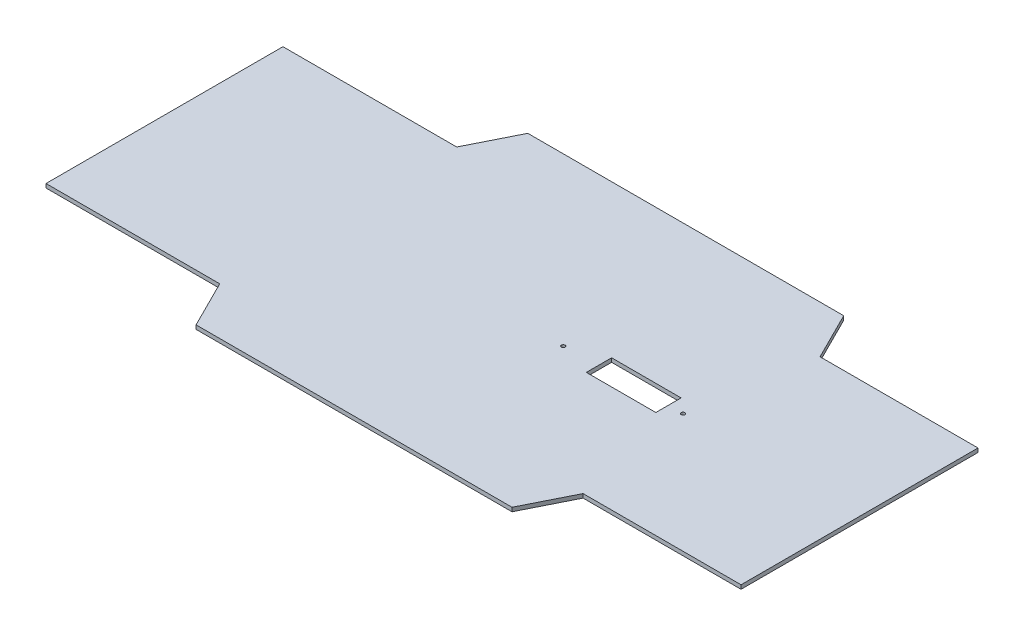
ISO-10303-21;
HEADER;
FILE_DESCRIPTION(('STEP AP214'),'2;1');
FILE_NAME('part.step','',(''),(''),'','','');
FILE_SCHEMA(('AUTOMOTIVE_DESIGN { 1 0 10303 214 1 1 1 1 }'));
ENDSEC;
DATA;
#1=APPLICATION_CONTEXT('core data for automotive mechanical design processes');
#2=APPLICATION_PROTOCOL_DEFINITION('international standard','automotive_design',2000,#1);
#3=PRODUCT_CONTEXT('',#1,'mechanical');
#4=PRODUCT('Part','Part','',(#3));
#5=PRODUCT_RELATED_PRODUCT_CATEGORY('part','',(#4));
#6=PRODUCT_DEFINITION_FORMATION('','',#4);
#7=PRODUCT_DEFINITION_CONTEXT('part definition',#1,'design');
#8=PRODUCT_DEFINITION('design','',#6,#7);
#9=PRODUCT_DEFINITION_SHAPE('','',#8);
#10=(LENGTH_UNIT() NAMED_UNIT(*) SI_UNIT(.MILLI.,.METRE.));
#11=(NAMED_UNIT(*) PLANE_ANGLE_UNIT() SI_UNIT($,.RADIAN.));
#12=(NAMED_UNIT(*) SI_UNIT($,.STERADIAN.) SOLID_ANGLE_UNIT());
#13=UNCERTAINTY_MEASURE_WITH_UNIT(LENGTH_MEASURE(1.E-05),#10,'distance_accuracy_value','');
#14=(GEOMETRIC_REPRESENTATION_CONTEXT(3) GLOBAL_UNCERTAINTY_ASSIGNED_CONTEXT((#13)) GLOBAL_UNIT_ASSIGNED_CONTEXT((#10,
#11,#12)) REPRESENTATION_CONTEXT('',''));
#15=CARTESIAN_POINT('',(0.,0.,0.));
#16=DIRECTION('',(0.,0.,1.));
#17=DIRECTION('',(1.,0.,0.));
#18=AXIS2_PLACEMENT_3D('',#15,#16,#17);
#19=CARTESIAN_POINT('',(279.4,1.5875,-95.25));
#20=DIRECTION('',(-1.,0.,0.));
#21=DIRECTION('',(0.,0.,1.));
#22=AXIS2_PLACEMENT_3D('',#19,#20,#21);
#23=PLANE('',#22);
#24=DIRECTION('',(0.,0.,-1.));
#25=VECTOR('',#24,1.);
#26=CARTESIAN_POINT('',(279.4,-1.5875,-95.25));
#27=LINE('',#26,#25);
#28=CARTESIAN_POINT('',(279.4,-1.5875,95.25));
#29=VERTEX_POINT('',#28);
#30=CARTESIAN_POINT('',(279.4,-1.5875,-95.25));
#31=VERTEX_POINT('',#30);
#32=EDGE_CURVE('E203',#29,#31,#27,.T.);
#33=ORIENTED_EDGE('',*,*,#32,.T.);
#34=DIRECTION('',(0.,-1.,0.));
#35=VECTOR('',#34,1.);
#36=CARTESIAN_POINT('',(279.4,1.5875,-95.25));
#37=LINE('',#36,#35);
#38=CARTESIAN_POINT('',(279.4,1.5875,-95.25));
#39=VERTEX_POINT('',#38);
#40=EDGE_CURVE('E259',#39,#31,#37,.T.);
#41=ORIENTED_EDGE('',*,*,#40,.F.);
#42=DIRECTION('',(0.,0.,-1.));
#43=VECTOR('',#42,1.);
#44=CARTESIAN_POINT('',(279.4,1.5875,-95.25));
#45=LINE('',#44,#43);
#46=CARTESIAN_POINT('',(279.4,1.5875,95.25));
#47=VERTEX_POINT('',#46);
#48=EDGE_CURVE('E176',#47,#39,#45,.T.);
#49=ORIENTED_EDGE('',*,*,#48,.F.);
#50=DIRECTION('',(0.,-1.,0.));
#51=VECTOR('',#50,1.);
#52=CARTESIAN_POINT('',(279.4,1.5875,95.25));
#53=LINE('',#52,#51);
#54=EDGE_CURVE('E202',#47,#29,#53,.T.);
#55=ORIENTED_EDGE('',*,*,#54,.T.);
#56=EDGE_LOOP('',(#33,#41,#49,#55));
#57=FACE_BOUND('',#56,.T.);
#58=ADVANCED_FACE('F33',(#57),#23,.F.);
#59=CARTESIAN_POINT('',(152.4,1.5875,-95.25));
#60=DIRECTION('',(0.,0.,1.));
#61=DIRECTION('',(1.,0.,0.));
#62=AXIS2_PLACEMENT_3D('',#59,#60,#61);
#63=PLANE('',#62);
#64=DIRECTION('',(-1.,0.,0.));
#65=VECTOR('',#64,1.);
#66=CARTESIAN_POINT('',(152.4,-1.5875,-95.25));
#67=LINE('',#66,#65);
#68=CARTESIAN_POINT('',(152.4,-1.5875,-95.25));
#69=VERTEX_POINT('',#68);
#70=EDGE_CURVE('E206',#31,#69,#67,.T.);
#71=ORIENTED_EDGE('',*,*,#70,.T.);
#72=DIRECTION('',(0.,-1.,0.));
#73=VECTOR('',#72,1.);
#74=CARTESIAN_POINT('',(152.4,1.5875,-95.25));
#75=LINE('',#74,#73);
#76=CARTESIAN_POINT('',(152.4,1.5875,-95.25));
#77=VERTEX_POINT('',#76);
#78=EDGE_CURVE('E256',#77,#69,#75,.T.);
#79=ORIENTED_EDGE('',*,*,#78,.F.);
#80=DIRECTION('',(-1.,0.,0.));
#81=VECTOR('',#80,1.);
#82=CARTESIAN_POINT('',(152.4,1.5875,-95.25));
#83=LINE('',#82,#81);
#84=EDGE_CURVE('E179',#39,#77,#83,.T.);
#85=ORIENTED_EDGE('',*,*,#84,.F.);
#86=ORIENTED_EDGE('',*,*,#40,.T.);
#87=EDGE_LOOP('',(#71,#79,#85,#86));
#88=FACE_BOUND('',#87,.T.);
#89=ADVANCED_FACE('F300',(#88),#63,.F.);
#90=CARTESIAN_POINT('',(133.35,1.5875,-133.35));
#91=DIRECTION('',(-0.894427190999916,0.,0.447213595499958));
#92=DIRECTION('',(0.447213595499958,0.,0.894427190999916));
#93=AXIS2_PLACEMENT_3D('',#90,#91,#92);
#94=PLANE('',#93);
#95=DIRECTION('',(-0.447213595499958,0.,-0.894427190999916));
#96=VECTOR('',#95,1.);
#97=CARTESIAN_POINT('',(133.35,-1.5875,-133.35));
#98=LINE('',#97,#96);
#99=CARTESIAN_POINT('',(133.35,-1.5875,-133.35));
#100=VERTEX_POINT('',#99);
#101=EDGE_CURVE('E208',#69,#100,#98,.T.);
#102=ORIENTED_EDGE('',*,*,#101,.T.);
#103=DIRECTION('',(0.,-1.,0.));
#104=VECTOR('',#103,1.);
#105=CARTESIAN_POINT('',(133.35,1.5875,-133.35));
#106=LINE('',#105,#104);
#107=CARTESIAN_POINT('',(133.35,1.5875,-133.35));
#108=VERTEX_POINT('',#107);
#109=EDGE_CURVE('E253',#108,#100,#106,.T.);
#110=ORIENTED_EDGE('',*,*,#109,.F.);
#111=DIRECTION('',(-0.447213595499958,0.,-0.894427190999916));
#112=VECTOR('',#111,1.);
#113=CARTESIAN_POINT('',(133.35,1.5875,-133.35));
#114=LINE('',#113,#112);
#115=EDGE_CURVE('E182',#77,#108,#114,.T.);
#116=ORIENTED_EDGE('',*,*,#115,.F.);
#117=ORIENTED_EDGE('',*,*,#78,.T.);
#118=EDGE_LOOP('',(#102,#110,#116,#117));
#119=FACE_BOUND('',#118,.T.);
#120=ADVANCED_FACE('F305',(#119),#94,.F.);
#121=CARTESIAN_POINT('',(-120.65,1.5875,-133.35));
#122=DIRECTION('',(0.,0.,1.));
#123=DIRECTION('',(1.,0.,0.));
#124=AXIS2_PLACEMENT_3D('',#121,#122,#123);
#125=PLANE('',#124);
#126=DIRECTION('',(-1.,0.,0.));
#127=VECTOR('',#126,1.);
#128=CARTESIAN_POINT('',(-120.65,-1.5875,-133.35));
#129=LINE('',#128,#127);
#130=CARTESIAN_POINT('',(-120.65,-1.5875,-133.35));
#131=VERTEX_POINT('',#130);
#132=EDGE_CURVE('E210',#100,#131,#129,.T.);
#133=ORIENTED_EDGE('',*,*,#132,.T.);
#134=DIRECTION('',(0.,-1.,0.));
#135=VECTOR('',#134,1.);
#136=CARTESIAN_POINT('',(-120.65,1.5875,-133.35));
#137=LINE('',#136,#135);
#138=CARTESIAN_POINT('',(-120.65,1.5875,-133.35));
#139=VERTEX_POINT('',#138);
#140=EDGE_CURVE('E250',#139,#131,#137,.T.);
#141=ORIENTED_EDGE('',*,*,#140,.F.);
#142=DIRECTION('',(-1.,0.,0.));
#143=VECTOR('',#142,1.);
#144=CARTESIAN_POINT('',(-120.65,1.5875,-133.35));
#145=LINE('',#144,#143);
#146=EDGE_CURVE('E184',#108,#139,#145,.T.);
#147=ORIENTED_EDGE('',*,*,#146,.F.);
#148=ORIENTED_EDGE('',*,*,#109,.T.);
#149=EDGE_LOOP('',(#133,#141,#147,#148));
#150=FACE_BOUND('',#149,.T.);
#151=ADVANCED_FACE('F354',(#150),#125,.F.);
#152=CARTESIAN_POINT('',(-139.7,1.5875,-95.25));
#153=DIRECTION('',(0.894427190999916,0.,0.447213595499958));
#154=DIRECTION('',(0.447213595499958,0.,-0.894427190999916));
#155=AXIS2_PLACEMENT_3D('',#152,#153,#154);
#156=PLANE('',#155);
#157=DIRECTION('',(-0.447213595499958,0.,0.894427190999916));
#158=VECTOR('',#157,1.);
#159=CARTESIAN_POINT('',(-139.7,-1.5875,-95.25));
#160=LINE('',#159,#158);
#161=CARTESIAN_POINT('',(-139.7,-1.5875,-95.25));
#162=VERTEX_POINT('',#161);
#163=EDGE_CURVE('E212',#131,#162,#160,.T.);
#164=ORIENTED_EDGE('',*,*,#163,.T.);
#165=DIRECTION('',(0.,-1.,0.));
#166=VECTOR('',#165,1.);
#167=CARTESIAN_POINT('',(-139.7,1.5875,-95.25));
#168=LINE('',#167,#166);
#169=CARTESIAN_POINT('',(-139.7,1.5875,-95.25));
#170=VERTEX_POINT('',#169);
#171=EDGE_CURVE('E247',#170,#162,#168,.T.);
#172=ORIENTED_EDGE('',*,*,#171,.F.);
#173=DIRECTION('',(-0.447213595499958,0.,0.894427190999916));
#174=VECTOR('',#173,1.);
#175=CARTESIAN_POINT('',(-139.7,1.5875,-95.25));
#176=LINE('',#175,#174);
#177=EDGE_CURVE('E186',#139,#170,#176,.T.);
#178=ORIENTED_EDGE('',*,*,#177,.F.);
#179=ORIENTED_EDGE('',*,*,#140,.T.);
#180=EDGE_LOOP('',(#164,#172,#178,#179));
#181=FACE_BOUND('',#180,.T.);
#182=ADVANCED_FACE('F351',(#181),#156,.F.);
#183=CARTESIAN_POINT('',(-279.4,1.5875,-95.25));
#184=DIRECTION('',(0.,0.,1.));
#185=DIRECTION('',(1.,0.,0.));
#186=AXIS2_PLACEMENT_3D('',#183,#184,#185);
#187=PLANE('',#186);
#188=DIRECTION('',(-1.,0.,0.));
#189=VECTOR('',#188,1.);
#190=CARTESIAN_POINT('',(-279.4,-1.5875,-95.25));
#191=LINE('',#190,#189);
#192=CARTESIAN_POINT('',(-279.4,-1.5875,-95.25));
#193=VERTEX_POINT('',#192);
#194=EDGE_CURVE('E214',#162,#193,#191,.T.);
#195=ORIENTED_EDGE('',*,*,#194,.T.);
#196=DIRECTION('',(0.,-1.,0.));
#197=VECTOR('',#196,1.);
#198=CARTESIAN_POINT('',(-279.4,1.5875,-95.25));
#199=LINE('',#198,#197);
#200=CARTESIAN_POINT('',(-279.4,1.5875,-95.25));
#201=VERTEX_POINT('',#200);
#202=EDGE_CURVE('E244',#201,#193,#199,.T.);
#203=ORIENTED_EDGE('',*,*,#202,.F.);
#204=DIRECTION('',(-1.,0.,0.));
#205=VECTOR('',#204,1.);
#206=CARTESIAN_POINT('',(-279.4,1.5875,-95.25));
#207=LINE('',#206,#205);
#208=EDGE_CURVE('E188',#170,#201,#207,.T.);
#209=ORIENTED_EDGE('',*,*,#208,.F.);
#210=ORIENTED_EDGE('',*,*,#171,.T.);
#211=EDGE_LOOP('',(#195,#203,#209,#210));
#212=FACE_BOUND('',#211,.T.);
#213=ADVANCED_FACE('F347',(#212),#187,.F.);
#214=CARTESIAN_POINT('',(-279.4,1.5875,-95.25));
#215=DIRECTION('',(1.,0.,0.));
#216=DIRECTION('',(0.,0.,-1.));
#217=AXIS2_PLACEMENT_3D('',#214,#215,#216);
#218=PLANE('',#217);
#219=DIRECTION('',(0.,0.,1.));
#220=VECTOR('',#219,1.);
#221=CARTESIAN_POINT('',(-279.4,-1.5875,-95.25));
#222=LINE('',#221,#220);
#223=CARTESIAN_POINT('',(-279.4,-1.5875,95.25));
#224=VERTEX_POINT('',#223);
#225=EDGE_CURVE('E216',#193,#224,#222,.T.);
#226=ORIENTED_EDGE('',*,*,#225,.T.);
#227=DIRECTION('',(0.,-1.,0.));
#228=VECTOR('',#227,1.);
#229=CARTESIAN_POINT('',(-279.4,1.5875,95.25));
#230=LINE('',#229,#228);
#231=CARTESIAN_POINT('',(-279.4,1.5875,95.25));
#232=VERTEX_POINT('',#231);
#233=EDGE_CURVE('E241',#232,#224,#230,.T.);
#234=ORIENTED_EDGE('',*,*,#233,.F.);
#235=DIRECTION('',(0.,0.,1.));
#236=VECTOR('',#235,1.);
#237=CARTESIAN_POINT('',(-279.4,1.5875,-95.25));
#238=LINE('',#237,#236);
#239=EDGE_CURVE('E190',#201,#232,#238,.T.);
#240=ORIENTED_EDGE('',*,*,#239,.F.);
#241=ORIENTED_EDGE('',*,*,#202,.T.);
#242=EDGE_LOOP('',(#226,#234,#240,#241));
#243=FACE_BOUND('',#242,.T.);
#244=ADVANCED_FACE('F342',(#243),#218,.F.);
#245=CARTESIAN_POINT('',(-279.4,1.5875,95.25));
#246=DIRECTION('',(0.,0.,-1.));
#247=DIRECTION('',(-1.,0.,0.));
#248=AXIS2_PLACEMENT_3D('',#245,#246,#247);
#249=PLANE('',#248);
#250=DIRECTION('',(1.,0.,0.));
#251=VECTOR('',#250,1.);
#252=CARTESIAN_POINT('',(-279.4,-1.5875,95.25));
#253=LINE('',#252,#251);
#254=CARTESIAN_POINT('',(-139.7,-1.5875,95.25));
#255=VERTEX_POINT('',#254);
#256=EDGE_CURVE('E218',#224,#255,#253,.T.);
#257=ORIENTED_EDGE('',*,*,#256,.T.);
#258=DIRECTION('',(0.,-1.,0.));
#259=VECTOR('',#258,1.);
#260=CARTESIAN_POINT('',(-139.7,1.5875,95.25));
#261=LINE('',#260,#259);
#262=CARTESIAN_POINT('',(-139.7,1.5875,95.25));
#263=VERTEX_POINT('',#262);
#264=EDGE_CURVE('E238',#263,#255,#261,.T.);
#265=ORIENTED_EDGE('',*,*,#264,.F.);
#266=DIRECTION('',(1.,0.,0.));
#267=VECTOR('',#266,1.);
#268=CARTESIAN_POINT('',(-279.4,1.5875,95.25));
#269=LINE('',#268,#267);
#270=EDGE_CURVE('E192',#232,#263,#269,.T.);
#271=ORIENTED_EDGE('',*,*,#270,.F.);
#272=ORIENTED_EDGE('',*,*,#233,.T.);
#273=EDGE_LOOP('',(#257,#265,#271,#272));
#274=FACE_BOUND('',#273,.T.);
#275=ADVANCED_FACE('F336',(#274),#249,.F.);
#276=CARTESIAN_POINT('',(-139.7,1.5875,95.25));
#277=DIRECTION('',(0.894427190999916,0.,-0.447213595499958));
#278=DIRECTION('',(-0.447213595499958,0.,-0.894427190999916));
#279=AXIS2_PLACEMENT_3D('',#276,#277,#278);
#280=PLANE('',#279);
#281=DIRECTION('',(0.447213595499958,0.,0.894427190999916));
#282=VECTOR('',#281,1.);
#283=CARTESIAN_POINT('',(-139.7,-1.5875,95.25));
#284=LINE('',#283,#282);
#285=CARTESIAN_POINT('',(-120.65,-1.5875,133.35));
#286=VERTEX_POINT('',#285);
#287=EDGE_CURVE('E220',#255,#286,#284,.T.);
#288=ORIENTED_EDGE('',*,*,#287,.T.);
#289=DIRECTION('',(0.,-1.,0.));
#290=VECTOR('',#289,1.);
#291=CARTESIAN_POINT('',(-120.65,1.5875,133.35));
#292=LINE('',#291,#290);
#293=CARTESIAN_POINT('',(-120.65,1.5875,133.35));
#294=VERTEX_POINT('',#293);
#295=EDGE_CURVE('E235',#294,#286,#292,.T.);
#296=ORIENTED_EDGE('',*,*,#295,.F.);
#297=DIRECTION('',(0.447213595499958,0.,0.894427190999916));
#298=VECTOR('',#297,1.);
#299=CARTESIAN_POINT('',(-139.7,1.5875,95.25));
#300=LINE('',#299,#298);
#301=EDGE_CURVE('E194',#263,#294,#300,.T.);
#302=ORIENTED_EDGE('',*,*,#301,.F.);
#303=ORIENTED_EDGE('',*,*,#264,.T.);
#304=EDGE_LOOP('',(#288,#296,#302,#303));
#305=FACE_BOUND('',#304,.T.);
#306=ADVANCED_FACE('F332',(#305),#280,.F.);
#307=CARTESIAN_POINT('',(-120.65,1.5875,133.35));
#308=DIRECTION('',(0.,0.,-1.));
#309=DIRECTION('',(-1.,0.,0.));
#310=AXIS2_PLACEMENT_3D('',#307,#308,#309);
#311=PLANE('',#310);
#312=DIRECTION('',(1.,0.,0.));
#313=VECTOR('',#312,1.);
#314=CARTESIAN_POINT('',(-120.65,-1.5875,133.35));
#315=LINE('',#314,#313);
#316=CARTESIAN_POINT('',(133.35,-1.5875,133.35));
#317=VERTEX_POINT('',#316);
#318=EDGE_CURVE('E222',#286,#317,#315,.T.);
#319=ORIENTED_EDGE('',*,*,#318,.T.);
#320=DIRECTION('',(0.,-1.,0.));
#321=VECTOR('',#320,1.);
#322=CARTESIAN_POINT('',(133.35,1.5875,133.35));
#323=LINE('',#322,#321);
#324=CARTESIAN_POINT('',(133.35,1.5875,133.35));
#325=VERTEX_POINT('',#324);
#326=EDGE_CURVE('E232',#325,#317,#323,.T.);
#327=ORIENTED_EDGE('',*,*,#326,.F.);
#328=DIRECTION('',(1.,0.,0.));
#329=VECTOR('',#328,1.);
#330=CARTESIAN_POINT('',(-120.65,1.5875,133.35));
#331=LINE('',#330,#329);
#332=EDGE_CURVE('E196',#294,#325,#331,.T.);
#333=ORIENTED_EDGE('',*,*,#332,.F.);
#334=ORIENTED_EDGE('',*,*,#295,.T.);
#335=EDGE_LOOP('',(#319,#327,#333,#334));
#336=FACE_BOUND('',#335,.T.);
#337=ADVANCED_FACE('F327',(#336),#311,.F.);
#338=CARTESIAN_POINT('',(133.35,1.5875,133.35));
#339=DIRECTION('',(-0.894427190999916,0.,-0.447213595499958));
#340=DIRECTION('',(-0.447213595499958,0.,0.894427190999916));
#341=AXIS2_PLACEMENT_3D('',#338,#339,#340);
#342=PLANE('',#341);
#343=DIRECTION('',(0.447213595499958,0.,-0.894427190999916));
#344=VECTOR('',#343,1.);
#345=CARTESIAN_POINT('',(133.35,-1.5875,133.35));
#346=LINE('',#345,#344);
#347=CARTESIAN_POINT('',(152.4,-1.5875,95.25));
#348=VERTEX_POINT('',#347);
#349=EDGE_CURVE('E224',#317,#348,#346,.T.);
#350=ORIENTED_EDGE('',*,*,#349,.T.);
#351=DIRECTION('',(0.,-1.,0.));
#352=VECTOR('',#351,1.);
#353=CARTESIAN_POINT('',(152.4,1.5875,95.25));
#354=LINE('',#353,#352);
#355=CARTESIAN_POINT('',(152.4,1.5875,95.25));
#356=VERTEX_POINT('',#355);
#357=EDGE_CURVE('E229',#356,#348,#354,.T.);
#358=ORIENTED_EDGE('',*,*,#357,.F.);
#359=DIRECTION('',(0.447213595499958,0.,-0.894427190999916));
#360=VECTOR('',#359,1.);
#361=CARTESIAN_POINT('',(133.35,1.5875,133.35));
#362=LINE('',#361,#360);
#363=EDGE_CURVE('E198',#325,#356,#362,.T.);
#364=ORIENTED_EDGE('',*,*,#363,.F.);
#365=ORIENTED_EDGE('',*,*,#326,.T.);
#366=EDGE_LOOP('',(#350,#358,#364,#365));
#367=FACE_BOUND('',#366,.T.);
#368=ADVANCED_FACE('F295',(#367),#342,.F.);
#369=CARTESIAN_POINT('',(152.4,1.5875,95.25));
#370=DIRECTION('',(0.,0.,-1.));
#371=DIRECTION('',(-1.,0.,0.));
#372=AXIS2_PLACEMENT_3D('',#369,#370,#371);
#373=PLANE('',#372);
#374=DIRECTION('',(1.,0.,0.));
#375=VECTOR('',#374,1.);
#376=CARTESIAN_POINT('',(152.4,-1.5875,95.25));
#377=LINE('',#376,#375);
#378=EDGE_CURVE('E180',#348,#29,#377,.T.);
#379=ORIENTED_EDGE('',*,*,#378,.T.);
#380=ORIENTED_EDGE('',*,*,#54,.F.);
#381=DIRECTION('',(1.,0.,0.));
#382=VECTOR('',#381,1.);
#383=CARTESIAN_POINT('',(152.4,1.5875,95.25));
#384=LINE('',#383,#382);
#385=EDGE_CURVE('E200',#356,#47,#384,.T.);
#386=ORIENTED_EDGE('',*,*,#385,.F.);
#387=ORIENTED_EDGE('',*,*,#357,.T.);
#388=EDGE_LOOP('',(#379,#380,#386,#387));
#389=FACE_BOUND('',#388,.T.);
#390=ADVANCED_FACE('F285',(#389),#373,.F.);
#391=CARTESIAN_POINT('',(0.,1.5875,0.));
#392=DIRECTION('',(0.,1.,0.));
#393=DIRECTION('',(0.,0.,1.));
#394=AXIS2_PLACEMENT_3D('',#391,#392,#393);
#395=PLANE('',#394);
#396=CARTESIAN_POINT('',(136.914734298765,1.5875,-0.595522160814228));
#397=DIRECTION('',(0.,1.,0.));
#398=DIRECTION('',(0.,0.,1.));
#399=AXIS2_PLACEMENT_3D('',#396,#397,#398);
#400=CIRCLE('',#399,1.4986);
#401=CARTESIAN_POINT('',(136.914734298765,1.5875,0.903077839185777));
#402=VERTEX_POINT('',#401);
#403=EDGE_CURVE('E268',#402,#402,#400,.T.);
#404=ORIENTED_EDGE('',*,*,#403,.F.);
#405=EDGE_LOOP('',(#404));
#406=FACE_BOUND('',#405,.T.);
#407=CARTESIAN_POINT('',(41.7844690699467,1.5875,0.595522160814183));
#408=DIRECTION('',(0.,1.,0.));
#409=DIRECTION('',(0.,0.,1.));
#410=AXIS2_PLACEMENT_3D('',#407,#408,#409);
#411=CIRCLE('',#410,1.48991223565335);
#412=CARTESIAN_POINT('',(41.7844690699467,1.5875,2.08543439646754));
#413=VERTEX_POINT('',#412);
#414=EDGE_CURVE('E173',#413,#413,#411,.T.);
#415=ORIENTED_EDGE('',*,*,#414,.F.);
#416=EDGE_LOOP('',(#415));
#417=FACE_BOUND('',#416,.T.);
#418=DIRECTION('',(0.,0.,-1.));
#419=VECTOR('',#418,1.);
#420=CARTESIAN_POINT('',(125.205334298765,1.5875,-10.7555221608142));
#421=LINE('',#420,#419);
#422=CARTESIAN_POINT('',(125.205334298765,1.5875,9.56447783918578));
#423=VERTEX_POINT('',#422);
#424=CARTESIAN_POINT('',(125.205334298765,1.5875,-10.7555221608142));
#425=VERTEX_POINT('',#424);
#426=EDGE_CURVE('E49',#423,#425,#421,.T.);
#427=ORIENTED_EDGE('',*,*,#426,.F.);
#428=DIRECTION('',(1.,0.,0.));
#429=VECTOR('',#428,1.);
#430=CARTESIAN_POINT('',(69.3253342987648,1.5875,9.56447783918578));
#431=LINE('',#430,#429);
#432=CARTESIAN_POINT('',(69.3253342987648,1.5875,9.56447783918578));
#433=VERTEX_POINT('',#432);
#434=EDGE_CURVE('E166',#433,#423,#431,.T.);
#435=ORIENTED_EDGE('',*,*,#434,.F.);
#436=DIRECTION('',(0.,0.,1.));
#437=VECTOR('',#436,1.);
#438=CARTESIAN_POINT('',(69.3253342987648,1.5875,-10.7555221608142));
#439=LINE('',#438,#437);
#440=CARTESIAN_POINT('',(69.3253342987648,1.5875,-10.7555221608142));
#441=VERTEX_POINT('',#440);
#442=EDGE_CURVE('E150',#441,#433,#439,.T.);
#443=ORIENTED_EDGE('',*,*,#442,.F.);
#444=DIRECTION('',(-1.,0.,0.));
#445=VECTOR('',#444,1.);
#446=CARTESIAN_POINT('',(69.3253342987648,1.5875,-10.7555221608142));
#447=LINE('',#446,#445);
#448=EDGE_CURVE('E159',#425,#441,#447,.T.);
#449=ORIENTED_EDGE('',*,*,#448,.F.);
#450=EDGE_LOOP('',(#427,#435,#443,#449));
#451=FACE_BOUND('',#450,.T.);
#452=ORIENTED_EDGE('',*,*,#48,.T.);
#453=ORIENTED_EDGE('',*,*,#84,.T.);
#454=ORIENTED_EDGE('',*,*,#115,.T.);
#455=ORIENTED_EDGE('',*,*,#146,.T.);
#456=ORIENTED_EDGE('',*,*,#177,.T.);
#457=ORIENTED_EDGE('',*,*,#208,.T.);
#458=ORIENTED_EDGE('',*,*,#239,.T.);
#459=ORIENTED_EDGE('',*,*,#270,.T.);
#460=ORIENTED_EDGE('',*,*,#301,.T.);
#461=ORIENTED_EDGE('',*,*,#332,.T.);
#462=ORIENTED_EDGE('',*,*,#363,.T.);
#463=ORIENTED_EDGE('',*,*,#385,.T.);
#464=EDGE_LOOP('',(#452,#453,#454,#455,#456,#457,#458,#459,#460,#461,#462,#463));
#465=FACE_BOUND('',#464,.T.);
#466=ADVANCED_FACE('F163',(#406,#417,#451,#465),#395,.T.);
#467=CARTESIAN_POINT('',(0.,-1.5875,0.));
#468=DIRECTION('',(0.,1.,0.));
#469=DIRECTION('',(0.,0.,1.));
#470=AXIS2_PLACEMENT_3D('',#467,#468,#469);
#471=PLANE('',#470);
#472=CARTESIAN_POINT('',(136.914734298765,-1.5875,-0.595522160814228));
#473=DIRECTION('',(0.,1.,0.));
#474=DIRECTION('',(0.,0.,1.));
#475=AXIS2_PLACEMENT_3D('',#472,#473,#474);
#476=CIRCLE('',#475,1.4986);
#477=CARTESIAN_POINT('',(136.914734298765,-1.5875,0.903077839185777));
#478=VERTEX_POINT('',#477);
#479=EDGE_CURVE('E36',#478,#478,#476,.T.);
#480=ORIENTED_EDGE('',*,*,#479,.T.);
#481=EDGE_LOOP('',(#480));
#482=FACE_BOUND('',#481,.T.);
#483=CARTESIAN_POINT('',(41.7844690699467,-1.5875,0.595522160814183));
#484=DIRECTION('',(0.,1.,0.));
#485=DIRECTION('',(0.,0.,1.));
#486=AXIS2_PLACEMENT_3D('',#483,#484,#485);
#487=CIRCLE('',#486,1.48991223565335);
#488=CARTESIAN_POINT('',(41.7844690699467,-1.5875,2.08543439646754));
#489=VERTEX_POINT('',#488);
#490=EDGE_CURVE('E266',#489,#489,#487,.T.);
#491=ORIENTED_EDGE('',*,*,#490,.T.);
#492=EDGE_LOOP('',(#491));
#493=FACE_BOUND('',#492,.T.);
#494=DIRECTION('',(1.,0.,0.));
#495=VECTOR('',#494,1.);
#496=CARTESIAN_POINT('',(0.,-1.5875,9.56447783918578));
#497=LINE('',#496,#495);
#498=CARTESIAN_POINT('',(69.3253342987648,-1.5875,9.56447783918578));
#499=VERTEX_POINT('',#498);
#500=CARTESIAN_POINT('',(125.205334298765,-1.5875,9.56447783918578));
#501=VERTEX_POINT('',#500);
#502=EDGE_CURVE('E41',#499,#501,#497,.T.);
#503=ORIENTED_EDGE('',*,*,#502,.T.);
#504=DIRECTION('',(0.,0.,-1.));
#505=VECTOR('',#504,1.);
#506=CARTESIAN_POINT('',(125.205334298765,-1.5875,0.));
#507=LINE('',#506,#505);
#508=CARTESIAN_POINT('',(125.205334298765,-1.5875,-10.7555221608142));
#509=VERTEX_POINT('',#508);
#510=EDGE_CURVE('E11',#501,#509,#507,.T.);
#511=ORIENTED_EDGE('',*,*,#510,.T.);
#512=DIRECTION('',(-1.,0.,0.));
#513=VECTOR('',#512,1.);
#514=CARTESIAN_POINT('',(0.,-1.5875,-10.7555221608142));
#515=LINE('',#514,#513);
#516=CARTESIAN_POINT('',(69.3253342987648,-1.5875,-10.7555221608142));
#517=VERTEX_POINT('',#516);
#518=EDGE_CURVE('E262',#509,#517,#515,.T.);
#519=ORIENTED_EDGE('',*,*,#518,.T.);
#520=DIRECTION('',(0.,0.,1.));
#521=VECTOR('',#520,1.);
#522=CARTESIAN_POINT('',(69.3253342987648,-1.5875,0.));
#523=LINE('',#522,#521);
#524=EDGE_CURVE('E153',#517,#499,#523,.T.);
#525=ORIENTED_EDGE('',*,*,#524,.T.);
#526=EDGE_LOOP('',(#503,#511,#519,#525));
#527=FACE_BOUND('',#526,.T.);
#528=ORIENTED_EDGE('',*,*,#32,.F.);
#529=ORIENTED_EDGE('',*,*,#378,.F.);
#530=ORIENTED_EDGE('',*,*,#349,.F.);
#531=ORIENTED_EDGE('',*,*,#318,.F.);
#532=ORIENTED_EDGE('',*,*,#287,.F.);
#533=ORIENTED_EDGE('',*,*,#256,.F.);
#534=ORIENTED_EDGE('',*,*,#225,.F.);
#535=ORIENTED_EDGE('',*,*,#194,.F.);
#536=ORIENTED_EDGE('',*,*,#163,.F.);
#537=ORIENTED_EDGE('',*,*,#132,.F.);
#538=ORIENTED_EDGE('',*,*,#101,.F.);
#539=ORIENTED_EDGE('',*,*,#70,.F.);
#540=EDGE_LOOP('',(#528,#529,#530,#531,#532,#533,#534,#535,#536,#537,#538,#539));
#541=FACE_BOUND('',#540,.T.);
#542=ADVANCED_FACE('F284',(#482,#493,#527,#541),#471,.F.);
#543=CARTESIAN_POINT('',(125.205334298765,-18.7325,-10.7555221608142));
#544=DIRECTION('',(1.,0.,0.));
#545=DIRECTION('',(0.,0.,-1.));
#546=AXIS2_PLACEMENT_3D('',#543,#544,#545);
#547=PLANE('',#546);
#548=DIRECTION('',(0.,1.,0.));
#549=VECTOR('',#548,1.);
#550=CARTESIAN_POINT('',(125.205334298765,-18.7325,9.56447783918578));
#551=LINE('',#550,#549);
#552=EDGE_CURVE('E171',#501,#423,#551,.T.);
#553=ORIENTED_EDGE('',*,*,#552,.T.);
#554=ORIENTED_EDGE('',*,*,#426,.T.);
#555=DIRECTION('',(0.,1.,0.));
#556=VECTOR('',#555,1.);
#557=CARTESIAN_POINT('',(125.205334298765,-18.7325,-10.7555221608142));
#558=LINE('',#557,#556);
#559=EDGE_CURVE('E156',#509,#425,#558,.T.);
#560=ORIENTED_EDGE('',*,*,#559,.F.);
#561=ORIENTED_EDGE('',*,*,#510,.F.);
#562=EDGE_LOOP('',(#553,#554,#560,#561));
#563=FACE_BOUND('',#562,.T.);
#564=ADVANCED_FACE('F292',(#563),#547,.F.);
#565=CARTESIAN_POINT('',(69.3253342987648,-18.7325,9.56447783918578));
#566=DIRECTION('',(0.,0.,1.));
#567=DIRECTION('',(1.,0.,0.));
#568=AXIS2_PLACEMENT_3D('',#565,#566,#567);
#569=PLANE('',#568);
#570=DIRECTION('',(0.,1.,0.));
#571=VECTOR('',#570,1.);
#572=CARTESIAN_POINT('',(69.3253342987648,-18.7325,9.56447783918578));
#573=LINE('',#572,#571);
#574=EDGE_CURVE('E155',#499,#433,#573,.T.);
#575=ORIENTED_EDGE('',*,*,#574,.T.);
#576=ORIENTED_EDGE('',*,*,#434,.T.);
#577=ORIENTED_EDGE('',*,*,#552,.F.);
#578=ORIENTED_EDGE('',*,*,#502,.F.);
#579=EDGE_LOOP('',(#575,#576,#577,#578));
#580=FACE_BOUND('',#579,.T.);
#581=ADVANCED_FACE('F405',(#580),#569,.F.);
#582=CARTESIAN_POINT('',(69.3253342987648,-18.7325,-10.7555221608142));
#583=DIRECTION('',(-1.,0.,0.));
#584=DIRECTION('',(0.,0.,1.));
#585=AXIS2_PLACEMENT_3D('',#582,#583,#584);
#586=PLANE('',#585);
#587=DIRECTION('',(0.,1.,0.));
#588=VECTOR('',#587,1.);
#589=CARTESIAN_POINT('',(69.3253342987648,-18.7325,-10.7555221608142));
#590=LINE('',#589,#588);
#591=EDGE_CURVE('E57',#517,#441,#590,.T.);
#592=ORIENTED_EDGE('',*,*,#591,.T.);
#593=ORIENTED_EDGE('',*,*,#442,.T.);
#594=ORIENTED_EDGE('',*,*,#574,.F.);
#595=ORIENTED_EDGE('',*,*,#524,.F.);
#596=EDGE_LOOP('',(#592,#593,#594,#595));
#597=FACE_BOUND('',#596,.T.);
#598=ADVANCED_FACE('F147',(#597),#586,.F.);
#599=CARTESIAN_POINT('',(69.3253342987648,-18.7325,-10.7555221608142));
#600=DIRECTION('',(0.,0.,-1.));
#601=DIRECTION('',(-1.,0.,0.));
#602=AXIS2_PLACEMENT_3D('',#599,#600,#601);
#603=PLANE('',#602);
#604=ORIENTED_EDGE('',*,*,#559,.T.);
#605=ORIENTED_EDGE('',*,*,#448,.T.);
#606=ORIENTED_EDGE('',*,*,#591,.F.);
#607=ORIENTED_EDGE('',*,*,#518,.F.);
#608=EDGE_LOOP('',(#604,#605,#606,#607));
#609=FACE_BOUND('',#608,.T.);
#610=ADVANCED_FACE('F160',(#609),#603,.F.);
#611=CARTESIAN_POINT('',(41.7844690699467,-18.7325,0.595522160814183));
#612=DIRECTION('',(0.,1.,0.));
#613=DIRECTION('',(0.,0.,1.));
#614=AXIS2_PLACEMENT_3D('',#611,#612,#613);
#615=CYLINDRICAL_SURFACE('',#614,1.48991223565335);
#616=ORIENTED_EDGE('',*,*,#414,.T.);
#617=EDGE_LOOP('',(#616));
#618=FACE_BOUND('',#617,.T.);
#619=ORIENTED_EDGE('',*,*,#490,.F.);
#620=EDGE_LOOP('',(#619));
#621=FACE_BOUND('',#620,.T.);
#622=ADVANCED_FACE('F280',(#618,#621),#615,.F.);
#623=CARTESIAN_POINT('',(136.914734298765,-18.7325,-0.595522160814228));
#624=DIRECTION('',(0.,1.,0.));
#625=DIRECTION('',(0.,0.,1.));
#626=AXIS2_PLACEMENT_3D('',#623,#624,#625);
#627=CYLINDRICAL_SURFACE('',#626,1.4986);
#628=ORIENTED_EDGE('',*,*,#403,.T.);
#629=EDGE_LOOP('',(#628));
#630=FACE_BOUND('',#629,.T.);
#631=ORIENTED_EDGE('',*,*,#479,.F.);
#632=EDGE_LOOP('',(#631));
#633=FACE_BOUND('',#632,.T.);
#634=ADVANCED_FACE('F438',(#630,#633),#627,.F.);
#635=CLOSED_SHELL('',(#58,#89,#120,#151,#182,#213,#244,#275,#306,#337,#368,#390,#466,#542,#564,
#581,#598,#610,#622,#634));
#636=MANIFOLD_SOLID_BREP('B2',#635);
#637=ADVANCED_BREP_SHAPE_REPRESENTATION('',(#18,#636),#14);
#638=SHAPE_DEFINITION_REPRESENTATION(#9,#637);
ENDSEC;
END-ISO-10303-21;
